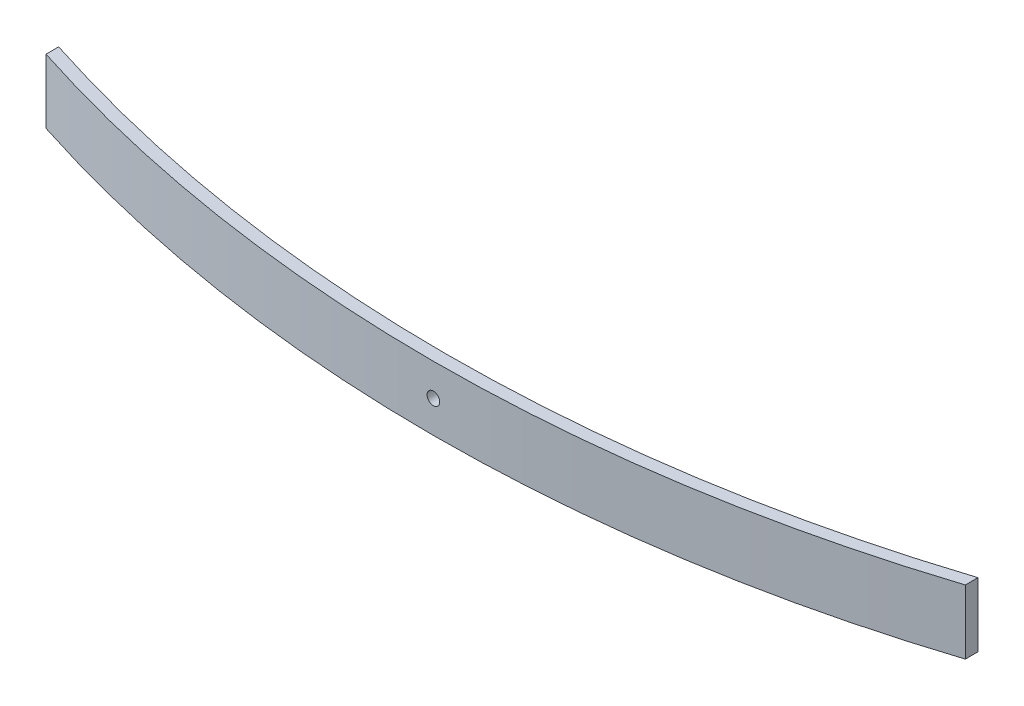
ISO-10303-21;
HEADER;
FILE_DESCRIPTION(('STEP AP214'),'2;1');
FILE_NAME('part.step','',(''),(''),'','','');
FILE_SCHEMA(('AUTOMOTIVE_DESIGN { 1 0 10303 214 1 1 1 1 }'));
ENDSEC;
DATA;
#1=APPLICATION_CONTEXT('core data for automotive mechanical design processes');
#2=APPLICATION_PROTOCOL_DEFINITION('international standard','automotive_design',2000,#1);
#3=PRODUCT_CONTEXT('',#1,'mechanical');
#4=PRODUCT('Part','Part','',(#3));
#5=PRODUCT_RELATED_PRODUCT_CATEGORY('part','',(#4));
#6=PRODUCT_DEFINITION_FORMATION('','',#4);
#7=PRODUCT_DEFINITION_CONTEXT('part definition',#1,'design');
#8=PRODUCT_DEFINITION('design','',#6,#7);
#9=PRODUCT_DEFINITION_SHAPE('','',#8);
#10=(LENGTH_UNIT() NAMED_UNIT(*) SI_UNIT(.MILLI.,.METRE.));
#11=(NAMED_UNIT(*) PLANE_ANGLE_UNIT() SI_UNIT($,.RADIAN.));
#12=(NAMED_UNIT(*) SI_UNIT($,.STERADIAN.) SOLID_ANGLE_UNIT());
#13=UNCERTAINTY_MEASURE_WITH_UNIT(LENGTH_MEASURE(1.E-05),#10,'distance_accuracy_value','');
#14=(GEOMETRIC_REPRESENTATION_CONTEXT(3) GLOBAL_UNCERTAINTY_ASSIGNED_CONTEXT((#13)) GLOBAL_UNIT_ASSIGNED_CONTEXT((#10,
#11,#12)) REPRESENTATION_CONTEXT('',''));
#15=CARTESIAN_POINT('',(0.,0.,0.));
#16=DIRECTION('',(0.,0.,1.));
#17=DIRECTION('',(1.,0.,0.));
#18=AXIS2_PLACEMENT_3D('',#15,#16,#17);
#19=CARTESIAN_POINT('',(6.91954253005793E-13,76.2,-1583.04997748713));
#20=DIRECTION('',(0.,-1.,0.));
#21=DIRECTION('',(0.,0.,-1.));
#22=AXIS2_PLACEMENT_3D('',#19,#20,#21);
#23=CYLINDRICAL_SURFACE('',#22,1776.04997748713);
#24=CARTESIAN_POINT('',(6.91954253005793E-13,0.,-1583.04997748713));
#25=DIRECTION('',(0.,1.,0.));
#26=DIRECTION('',(0.,0.,1.));
#27=AXIS2_PLACEMENT_3D('',#24,#25,#26);
#28=CIRCLE('',#27,1776.04997748713);
#29=CARTESIAN_POINT('',(545.021699517166,0.,107.306455217953));
#30=VERTEX_POINT('',#29);
#31=CARTESIAN_POINT('',(-545.021699517165,0.,107.306455217953));
#32=VERTEX_POINT('',#31);
#33=EDGE_CURVE('E121',#30,#32,#28,.F.);
#34=ORIENTED_EDGE('',*,*,#33,.F.);
#35=DIRECTION('',(0.,-1.,0.));
#36=VECTOR('',#35,1.);
#37=CARTESIAN_POINT('',(545.021699517166,76.2,107.306455217953));
#38=LINE('',#37,#36);
#39=CARTESIAN_POINT('',(545.021699517166,76.2,107.306455217953));
#40=VERTEX_POINT('',#39);
#41=EDGE_CURVE('E11',#40,#30,#38,.T.);
#42=ORIENTED_EDGE('',*,*,#41,.F.);
#43=CARTESIAN_POINT('',(6.91954253005793E-13,76.2,-1583.04997748713));
#44=DIRECTION('',(0.,1.,0.));
#45=DIRECTION('',(0.,0.,1.));
#46=AXIS2_PLACEMENT_3D('',#43,#44,#45);
#47=CIRCLE('',#46,1776.04997748713);
#48=CARTESIAN_POINT('',(-545.021699517165,76.2,107.306455217953));
#49=VERTEX_POINT('',#48);
#50=EDGE_CURVE('E113',#40,#49,#47,.F.);
#51=ORIENTED_EDGE('',*,*,#50,.T.);
#52=DIRECTION('',(0.,-1.,0.));
#53=VECTOR('',#52,1.);
#54=CARTESIAN_POINT('',(-545.021699517165,76.2,107.306455217953));
#55=LINE('',#54,#53);
#56=EDGE_CURVE('E94',#49,#32,#55,.T.);
#57=ORIENTED_EDGE('',*,*,#56,.T.);
#58=EDGE_LOOP('',(#34,#42,#51,#57));
#59=FACE_BOUND('',#58,.T.);
#60=CARTESIAN_POINT('',(6.91954253005793E-13,30.6,193.));
#61=CARTESIAN_POINT('',(-0.210713968094227,30.5999984867718,193.000000017793));
#62=CARTESIAN_POINT('',(-0.421403110930307,30.6088837241473,192.999962421728));
#63=CARTESIAN_POINT('',(-0.841354181845075,30.6443626478278,192.999813125687));
#64=CARTESIAN_POINT('',(-1.05061571988372,30.6709609920997,192.999701406219));
#65=CARTESIAN_POINT('',(-1.46633777348652,30.7417152082757,192.999406859924));
#66=CARTESIAN_POINT('',(-1.67279562512319,30.7858867143382,192.999223969782));
#67=CARTESIAN_POINT('',(-2.0813298290613,30.8914915499315,192.998792209094));
#68=CARTESIAN_POINT('',(-2.28340455125354,30.9529311869031,192.99854331444));
#69=CARTESIAN_POINT('',(-2.68152110119502,31.0925814227026,192.997986836868));
#70=CARTESIAN_POINT('',(-2.87756687230368,31.1707807807114,192.997679293301));
#71=CARTESIAN_POINT('',(-3.26237590887501,31.3434199132979,192.997014137911));
#72=CARTESIAN_POINT('',(-3.45113906456086,31.4378599325676,192.996656525334));
#73=CARTESIAN_POINT('',(-3.81998780495973,31.6422805388216,192.995901490769));
#74=CARTESIAN_POINT('',(-4.00007570143474,31.7522569546403,192.995504079474));
#75=CARTESIAN_POINT('',(-4.35035222525598,31.9869905222908,192.994680636077));
#76=CARTESIAN_POINT('',(-4.52054062300109,32.1117480167395,192.994254603313));
#77=CARTESIAN_POINT('',(-4.84979170206681,32.3751451316166,192.993386048449));
#78=CARTESIAN_POINT('',(-5.00885520931067,32.5137837196362,192.992943527578));
#79=CARTESIAN_POINT('',(-5.31479308067789,32.804015859957,192.992054369382));
#80=CARTESIAN_POINT('',(-5.46166320475902,32.9556138817967,192.991607730686));
#81=CARTESIAN_POINT('',(-5.74206362701607,33.2705952098563,192.990723311728));
#82=CARTESIAN_POINT('',(-5.87559815641338,33.4339747494297,192.990285528692));
#83=CARTESIAN_POINT('',(-6.12847828337017,33.7714630692385,192.989430939818));
#84=CARTESIAN_POINT('',(-6.24781862373892,33.9455757887628,192.989014141786));
#85=CARTESIAN_POINT('',(-6.47138111476824,34.3032005309569,192.988213616073));
#86=CARTESIAN_POINT('',(-6.57560639321524,34.4867105983514,192.987829881558));
#87=CARTESIAN_POINT('',(-6.76822875919948,34.8618615632203,192.98710627353));
#88=CARTESIAN_POINT('',(-6.85662560065925,35.0535025870455,192.986766400699));
#89=CARTESIAN_POINT('',(-7.01695887812265,35.4435460971775,192.986140178144));
#90=CARTESIAN_POINT('',(-7.08889566823617,35.6419484379205,192.98585382727));
#91=CARTESIAN_POINT('',(-7.21580133308599,36.0441127387914,192.985342762279));
#92=CARTESIAN_POINT('',(-7.27076981084048,36.2478748241922,192.985118049605));
#93=CARTESIAN_POINT('',(-7.36333699178468,36.6592665254965,192.984736685148));
#94=CARTESIAN_POINT('',(-7.40093897454976,36.8668954034648,192.984580020515));
#95=CARTESIAN_POINT('',(-7.45853120590766,37.2846549482939,192.984339094535));
#96=CARTESIAN_POINT('',(-7.47851535225067,37.4947864564638,192.984254858275));
#97=CARTESIAN_POINT('',(-7.50070359679289,37.9159102543566,192.984161289859));
#98=CARTESIAN_POINT('',(-7.50291408330494,38.1269022075299,192.98415193079));
#99=CARTESIAN_POINT('',(-7.48955360463759,38.5484004665777,192.984208322118));
#100=CARTESIAN_POINT('',(-7.47397607404448,38.7589065643839,192.984274100248));
#101=CARTESIAN_POINT('',(-7.42514452560697,39.1778160268159,192.984478922777));
#102=CARTESIAN_POINT('',(-7.39189401428347,39.3862198002114,192.984617952642));
#103=CARTESIAN_POINT('',(-7.30795445093899,39.7994886750939,192.984965325868));
#104=CARTESIAN_POINT('',(-7.25726512758641,40.0043537214695,192.985173670307));
#105=CARTESIAN_POINT('',(-7.13880941808669,40.4090816554468,192.985653753506));
#106=CARTESIAN_POINT('',(-7.07104334628342,40.6089446350507,192.985925491099));
#107=CARTESIAN_POINT('',(-6.91891409978115,41.0022558470397,192.986524655178));
#108=CARTESIAN_POINT('',(-6.8345505367465,41.1957039292102,192.986852082966));
#109=CARTESIAN_POINT('',(-6.64984230973413,41.5747716673117,192.987553267696));
#110=CARTESIAN_POINT('',(-6.54950055498283,41.7603927405773,192.9879270162));
#111=CARTESIAN_POINT('',(-6.33350673998462,42.1225834438655,192.988710406047));
#112=CARTESIAN_POINT('',(-6.2178493908568,42.2991499177421,192.989120059772));
#113=CARTESIAN_POINT('',(-5.97209494734002,42.6418601532703,192.98996341449));
#114=CARTESIAN_POINT('',(-5.84200303653242,42.808007623148,192.990397106822));
#115=CARTESIAN_POINT('',(-5.56830511634764,43.1287715124283,192.99127634415));
#116=CARTESIAN_POINT('',(-5.42469413510187,43.2833836517494,192.991721893463));
#117=CARTESIAN_POINT('',(-4.97502421482233,43.7281685004759,192.993057195178));
#118=CARTESIAN_POINT('',(-4.64986305950534,43.9996590137953,192.993946551662));
#119=CARTESIAN_POINT('',(-4.13197567971274,44.3627081259285,192.995201923407));
#120=CARTESIAN_POINT('',(-3.95423770702158,44.476400208607,192.99560743072));
#121=CARTESIAN_POINT('',(-3.58980904911005,44.6884506790729,192.996381434127));
#122=CARTESIAN_POINT('',(-3.40311815449559,44.7868087079931,192.996749929354));
#123=CARTESIAN_POINT('',(-2.8316530072115,45.0576661242202,192.99778332722));
#124=CARTESIAN_POINT('',(-2.43517114126789,45.2061693090255,192.998376934445));
#125=CARTESIAN_POINT('',(-1.62308827124615,45.4344169166339,192.999304792558));
#126=CARTESIAN_POINT('',(-1.20748726904315,45.5141613461805,192.999639043471));
#127=CARTESIAN_POINT('',(-0.368800144783835,45.6027859953173,193.000011208188));
#128=CARTESIAN_POINT('',(0.0542859194173199,45.6116667624026,193.000049124283));
#129=CARTESIAN_POINT('',(0.89613261813071,45.5581931101372,192.999823726225));
#130=CARTESIAN_POINT('',(1.31489325255112,45.4958386892742,192.999560412067));
#131=CARTESIAN_POINT('',(1.9303436787734,45.3504066256681,192.998962948761));
#132=CARTESIAN_POINT('',(2.1334669657173,45.2932419084604,192.998729895662));
#133=CARTESIAN_POINT('',(2.53416331768129,45.1620457959662,192.998203357605));
#134=CARTESIAN_POINT('',(2.73173651249174,45.0880147954716,192.997909874061));
#135=CARTESIAN_POINT('',(3.31406084676285,44.8412313409884,192.996950242197));
#136=CARTESIAN_POINT('',(3.68878109502303,44.643702073413,192.996204537467));
#137=CARTESIAN_POINT('',(4.22148178855349,44.3027303934533,192.994991984489));
#138=CARTESIAN_POINT('',(4.39423732139156,44.1815494254654,192.99457188216));
#139=CARTESIAN_POINT('',(4.72893486876222,43.9250760102941,192.993712173886));
#140=CARTESIAN_POINT('',(4.89088085068052,43.7897887877036,192.993272575197));
#141=CARTESIAN_POINT('',(5.2028389741045,43.5060131269228,192.992386135608));
#142=CARTESIAN_POINT('',(5.35284682055898,43.3575199778824,192.991939292171));
#143=CARTESIAN_POINT('',(5.6397731090037,43.0484737070598,192.99105133538));
#144=CARTESIAN_POINT('',(5.77669606336975,42.8879247771165,192.990610220097));
#145=CARTESIAN_POINT('',(6.03655633591654,42.5558335361285,192.989746002998));
#146=CARTESIAN_POINT('',(6.15949097179737,42.3842891264949,192.989322904647));
#147=CARTESIAN_POINT('',(6.39046942201517,42.0314575902563,192.98850682996));
#148=CARTESIAN_POINT('',(6.49851358458244,41.8501706916282,192.988113852918));
#149=CARTESIAN_POINT('',(6.69894774113189,41.4791360457973,192.987369158747));
#150=CARTESIAN_POINT('',(6.79133744698043,41.2893881429438,192.987017442377));
#151=CARTESIAN_POINT('',(6.95980221242439,40.9027865931229,192.986365267457));
#152=CARTESIAN_POINT('',(7.03587752593871,40.7059330568041,192.986064808109));
#153=CARTESIAN_POINT('',(7.17118720449908,40.306479201796,192.985523618733));
#154=CARTESIAN_POINT('',(7.23041839084969,40.1038778063374,192.985282899979));
#155=CARTESIAN_POINT('',(7.33158072491736,39.6944803968457,192.98486817799));
#156=CARTESIAN_POINT('',(7.37351824975515,39.4876859585839,192.984694150165));
#157=CARTESIAN_POINT('',(7.43983858987233,39.0712246263164,192.984417572838));
#158=CARTESIAN_POINT('',(7.46421508897779,38.8615567264146,192.984315049055));
#159=CARTESIAN_POINT('',(7.49521005598158,38.4409854893946,192.984184515178));
#160=CARTESIAN_POINT('',(7.50183466739308,38.2300826050059,192.984156479306));
#161=CARTESIAN_POINT('',(7.49729604901428,37.8084313167293,192.984175644233));
#162=CARTESIAN_POINT('',(7.48612970385177,37.5976829463639,192.984222858208));
#163=CARTESIAN_POINT('',(7.44608319144549,37.1778810074966,192.984391205324));
#164=CARTESIAN_POINT('',(7.41720343879293,36.9688273994439,192.984512336734));
#165=CARTESIAN_POINT('',(7.34193498439924,36.5538917028779,192.984825082016));
#166=CARTESIAN_POINT('',(7.29554590651526,36.3480096825968,192.985016697403));
#167=CARTESIAN_POINT('',(7.18558954382441,35.9408886735021,192.985464967259));
#168=CARTESIAN_POINT('',(7.12202252604807,35.7396496125666,192.985721620717));
#169=CARTESIAN_POINT('',(6.97814667319748,35.3431999543694,192.986292743016));
#170=CARTESIAN_POINT('',(6.89783430858562,35.1479906380158,192.986607224044));
#171=CARTESIAN_POINT('',(6.72107980430782,34.7651040508122,192.987284909401));
#172=CARTESIAN_POINT('',(6.6246436288667,34.5774240265772,192.987648095704));
#173=CARTESIAN_POINT('',(6.41627290528527,34.2107950839371,192.988413096412));
#174=CARTESIAN_POINT('',(6.30433343128913,34.0318489650879,192.988814923083));
#175=CARTESIAN_POINT('',(6.06581689289942,33.6840847361222,192.989645553125));
#176=CARTESIAN_POINT('',(5.93924490882296,33.515263141567,192.990074347111));
#177=CARTESIAN_POINT('',(5.67231991868936,33.1888660580897,192.990946907972));
#178=CARTESIAN_POINT('',(5.53196570521928,33.0312915565781,192.991390676157));
#179=CARTESIAN_POINT('',(5.23848659589243,32.7285285010311,192.992280544971));
#180=CARTESIAN_POINT('',(5.08536199605386,32.5833396600531,192.992726645546));
#181=CARTESIAN_POINT('',(4.76738488124515,32.3063385507572,192.993608647806));
#182=CARTESIAN_POINT('',(4.60252923302737,32.174529879134,192.994044546725));
#183=CARTESIAN_POINT('',(4.26230143452283,31.9252727160438,192.994893638276));
#184=CARTESIAN_POINT('',(4.08692944268945,31.8078240082912,192.995306831249));
#185=CARTESIAN_POINT('',(3.72679224644652,31.5880456665331,192.996099052417));
#186=CARTESIAN_POINT('',(3.54202080718477,31.4857262486002,192.996478057458));
#187=CARTESIAN_POINT('',(3.16457932589554,31.2970641063272,192.997190684133));
#188=CARTESIAN_POINT('',(2.97191219636486,31.2107155544448,192.997524322307));
#189=CARTESIAN_POINT('',(2.58015719959616,31.0546324777028,192.998136625653));
#190=CARTESIAN_POINT('',(2.38107520557399,30.9848832197952,192.998415339535));
#191=CARTESIAN_POINT('',(1.9778114443022,30.8624129523239,192.998910200255));
#192=CARTESIAN_POINT('',(1.77363103212966,30.8096874689386,192.999126363529));
#193=CARTESIAN_POINT('',(1.31020489979096,30.7106430274462,192.999535351372));
#194=CARTESIAN_POINT('',(1.04990557260826,30.6691871109608,192.99970896714));
#195=CARTESIAN_POINT('',(0.526391255001049,30.6138665423077,192.999941280342));
#196=CARTESIAN_POINT('',(0.263176264593172,30.6000018899827,192.999999977777));
#197=CARTESIAN_POINT('',(6.91954253005793E-13,30.6,193.));
#198=B_SPLINE_CURVE_WITH_KNOTS('',3,(#60,#61,#62,#63,#64,#65,#66,#67,#68,#69,#70,#71,#72,#73,
#74,#75,#76,#77,#78,#79,#80,#81,#82,#83,#84,#85,#86,#87,#88,#89,#90,#91,#92,#93,#94,#95,#96,#97,
#98,#99,#100,#101,#102,#103,#104,#105,#106,#107,#108,#109,#110,#111,#112,#113,#114,#115,#116,
#117,#118,#119,#120,#121,#122,#123,#124,#125,#126,#127,#128,#129,#130,#131,#132,#133,#134,#135,
#136,#137,#138,#139,#140,#141,#142,#143,#144,#145,#146,#147,#148,#149,#150,#151,#152,#153,#154,
#155,#156,#157,#158,#159,#160,#161,#162,#163,#164,#165,#166,#167,#168,#169,#170,#171,#172,#173,
#174,#175,#176,#177,#178,#179,#180,#181,#182,#183,#184,#185,#186,#187,#188,#189,#190,#191,#192,
#193,#194,#195,#196,#197),.UNSPECIFIED.,.T.,.F.,(4,2,2,2,2,2,2,2,2,2,2,2,2,2,2,2,2,2,2,2,2,2,2,
2,2,2,2,2,2,2,2,2,2,2,2,2,2,2,2,2,2,2,2,2,2,2,2,2,2,2,2,2,2,2,2,2,2,2,2,2,2,2,2,2,2,2,2,2,4),
(0.,0.631912024301777,1.2639902864152,1.89663214600144,2.52950538839113,3.16195548087539,
3.79441510307562,4.42670524595631,5.05901004782971,5.69126785680884,6.3237446098031,
6.95602004377837,7.58852893310258,8.2209067489129,8.85329439515875,9.48566843538515,
10.1180572691842,10.7503266306474,11.3828149038618,12.0150758342728,12.6475702025455,
13.2799391235442,13.9123178840565,14.5446850047721,15.177066922899,15.8093338315781,
16.4418196509556,17.0740790696136,17.7065719276866,18.9702098092056,19.602583667419,
20.2349723230349,21.4986105469059,22.7622486468442,24.0258769838608,25.2895053477042,
25.9218869189979,26.5542536895501,27.8178774792359,28.450372115571,29.0826333187677,
29.7151209754032,30.3473897231102,30.9797795065627,31.6121544983652,32.2445411283047,
32.8769179149983,33.509413959954,34.1416765599364,34.7741664524213,35.4064374266601,
36.0388191299599,36.6711860326123,37.3035665208155,37.9359371792494,38.5684412619989,
39.2007118959496,39.8331838838019,40.4654369370645,41.097745429307,41.7300392686788,
42.3625026260201,42.9949564562123,43.6278354202829,44.2604829982539,44.892566944869,
45.5244846453389,46.3137263294984,47.1029680091572),.UNSPECIFIED.);
#199=CARTESIAN_POINT('',(6.91954253005793E-13,30.6,193.));
#200=VERTEX_POINT('',#199);
#201=EDGE_CURVE('E124',#200,#200,#198,.T.);
#202=ORIENTED_EDGE('',*,*,#201,.T.);
#203=EDGE_LOOP('',(#202));
#204=FACE_BOUND('',#203,.T.);
#205=ADVANCED_FACE('F49',(#59,#204),#23,.T.);
#206=CARTESIAN_POINT('',(3.41240888505662E-13,76.2,-1598.04997748712));
#207=DIRECTION('',(0.,-1.,0.));
#208=DIRECTION('',(0.,0.,-1.));
#209=AXIS2_PLACEMENT_3D('',#206,#207,#208);
#210=CYLINDRICAL_SURFACE('',#209,1776.04997748712);
#211=CARTESIAN_POINT('',(3.41240888505662E-13,0.,-1598.04997748712));
#212=DIRECTION('',(0.,1.,0.));
#213=DIRECTION('',(0.,0.,1.));
#214=AXIS2_PLACEMENT_3D('',#211,#212,#213);
#215=CIRCLE('',#214,1776.04997748712);
#216=CARTESIAN_POINT('',(-545.021699517165,0.,92.3064552179532));
#217=VERTEX_POINT('',#216);
#218=CARTESIAN_POINT('',(545.021699517166,0.,92.3064552179535));
#219=VERTEX_POINT('',#218);
#220=EDGE_CURVE('E126',#217,#219,#215,.T.);
#221=ORIENTED_EDGE('',*,*,#220,.F.);
#222=DIRECTION('',(0.,-1.,0.));
#223=VECTOR('',#222,1.);
#224=CARTESIAN_POINT('',(-545.021699517165,76.2,92.3064552179532));
#225=LINE('',#224,#223);
#226=CARTESIAN_POINT('',(-545.021699517165,76.2,92.3064552179532));
#227=VERTEX_POINT('',#226);
#228=EDGE_CURVE('E87',#227,#217,#225,.T.);
#229=ORIENTED_EDGE('',*,*,#228,.F.);
#230=CARTESIAN_POINT('',(3.41240888505662E-13,76.2,-1598.04997748712));
#231=DIRECTION('',(0.,1.,0.));
#232=DIRECTION('',(0.,0.,1.));
#233=AXIS2_PLACEMENT_3D('',#230,#231,#232);
#234=CIRCLE('',#233,1776.04997748712);
#235=CARTESIAN_POINT('',(545.021699517166,76.2,92.3064552179535));
#236=VERTEX_POINT('',#235);
#237=EDGE_CURVE('E112',#227,#236,#234,.T.);
#238=ORIENTED_EDGE('',*,*,#237,.T.);
#239=DIRECTION('',(0.,-1.,0.));
#240=VECTOR('',#239,1.);
#241=CARTESIAN_POINT('',(545.021699517166,76.2,92.3064552179535));
#242=LINE('',#241,#240);
#243=EDGE_CURVE('E64',#236,#219,#242,.T.);
#244=ORIENTED_EDGE('',*,*,#243,.T.);
#245=EDGE_LOOP('',(#221,#229,#238,#244));
#246=FACE_BOUND('',#245,.T.);
#247=CARTESIAN_POINT('',(-7.5,38.1,177.984164226377));
#248=CARTESIAN_POINT('',(-7.50000151322819,37.8892860319145,177.984164208571));
#249=CARTESIAN_POINT('',(-7.49111627585349,37.6785968890879,177.984201804954));
#250=CARTESIAN_POINT('',(-7.45563735217615,37.2586458181922,177.984351102375));
#251=CARTESIAN_POINT('',(-7.42903900790671,37.0493842801633,177.984462822905));
#252=CARTESIAN_POINT('',(-7.35828479173724,36.63366222658,177.984757371678));
#253=CARTESIAN_POINT('',(-7.31411328567894,36.4272043749532,177.984940263235));
#254=CARTESIAN_POINT('',(-7.208508450096,36.018670171035,177.985372027225));
#255=CARTESIAN_POINT('',(-7.14706881313061,35.8165954488529,177.985620923766));
#256=CARTESIAN_POINT('',(-7.00741857734594,35.418478898933,177.98617740523));
#257=CARTESIAN_POINT('',(-6.92921921934607,35.2224331278356,177.986484950802));
#258=CARTESIAN_POINT('',(-6.75658008677935,34.837624091286,177.987150110131));
#259=CARTESIAN_POINT('',(-6.66214006752074,34.6488609356104,177.987507724643));
#260=CARTESIAN_POINT('',(-6.45771946129041,34.2800121952304,177.988262762777));
#261=CARTESIAN_POINT('',(-6.34774304548433,34.0999242987638,177.988660175705));
#262=CARTESIAN_POINT('',(-6.11300947786033,33.7496477749571,177.989483621892));
#263=CARTESIAN_POINT('',(-5.98825198342546,33.5794593772181,177.989909655814));
#264=CARTESIAN_POINT('',(-5.72485486856214,33.2502082981437,177.990778212374));
#265=CARTESIAN_POINT('',(-5.58621628054089,33.0911447908863,177.991220733785));
#266=CARTESIAN_POINT('',(-5.29598414021393,32.7852069194919,177.992109892413));
#267=CARTESIAN_POINT('',(-5.14438611836974,32.6383367953972,177.992556531002));
#268=CARTESIAN_POINT('',(-4.82940479029845,32.3579363731136,177.993440949047));
#269=CARTESIAN_POINT('',(-4.66602525071788,32.2244018437033,177.993878731278));
#270=CARTESIAN_POINT('',(-4.32853693089197,31.9715217167215,177.994733317997));
#271=CARTESIAN_POINT('',(-4.15442421135789,31.8521813763408,177.99515011468));
#272=CARTESIAN_POINT('',(-3.79679946915635,31.6286188852982,177.995950637268));
#273=CARTESIAN_POINT('',(-3.61328940176485,31.5243936068487,177.996334370008));
#274=CARTESIAN_POINT('',(-3.23813843690194,31.331771240859,177.997057974284));
#275=CARTESIAN_POINT('',(-3.04649741307953,31.2433743993964,177.997397845139));
#276=CARTESIAN_POINT('',(-2.65645390295346,31.083041121927,177.998024063725));
#277=CARTESIAN_POINT('',(-2.4580515622135,31.0111043318103,177.998310412606));
#278=CARTESIAN_POINT('',(-2.05588726134913,30.8841986669541,177.998821473858));
#279=CARTESIAN_POINT('',(-1.85212517595196,30.8292301891963,177.999046184785));
#280=CARTESIAN_POINT('',(-1.44073347465677,30.7366630082454,177.999427546169));
#281=CARTESIAN_POINT('',(-1.23310459669403,30.6990610254769,177.999584209475));
#282=CARTESIAN_POINT('',(-0.815345051876456,30.6414687941111,177.999825133398));
#283=CARTESIAN_POINT('',(-0.605213543712585,30.6214846477638,177.999909368927));
#284=CARTESIAN_POINT('',(-0.184089745831482,30.5992964032119,178.000002936514));
#285=CARTESIAN_POINT('',(0.0269022073360946,30.5970859166945,178.000012295484));
#286=CARTESIAN_POINT('',(0.44840046637314,30.6104463953503,177.999955904647));
#287=CARTESIAN_POINT('',(0.65890656417437,30.6260239259372,177.999890127108));
#288=CARTESIAN_POINT('',(1.07781602663256,30.6748554743656,177.999685306357));
#289=CARTESIAN_POINT('',(1.28621980005893,30.7081059856891,177.999546277678));
#290=CARTESIAN_POINT('',(1.69948867500321,30.792045549039,177.999198907314));
#291=CARTESIAN_POINT('',(1.90435372140975,30.842734872397,177.998990564549));
#292=CARTESIAN_POINT('',(2.30908165544806,30.9611905819128,177.998510484954));
#293=CARTESIAN_POINT('',(2.50894463508203,31.0289566537268,177.998238749291));
#294=CARTESIAN_POINT('',(2.90225584712975,31.1810859002556,177.997639589155));
#295=CARTESIAN_POINT('',(3.09570392932878,31.2654494633062,177.997312163378));
#296=CARTESIAN_POINT('',(3.474771667466,31.4501576903461,177.996610982501));
#297=CARTESIAN_POINT('',(3.6603927407395,31.5504994451075,177.996237235837));
#298=CARTESIAN_POINT('',(4.02258344404181,31.766493260127,177.99545384932));
#299=CARTESIAN_POINT('',(4.1991499179246,31.8821506092661,177.995044197084));
#300=CARTESIAN_POINT('',(4.54186015346291,32.1279050528061,177.994200844778));
#301=CARTESIAN_POINT('',(4.70800762334451,32.2579969636256,177.993767153369));
#302=CARTESIAN_POINT('',(5.02877151263007,32.5316948838342,177.992887917265));
#303=CARTESIAN_POINT('',(5.18338365195258,32.675305865092,177.992442368252));
#304=CARTESIAN_POINT('',(5.62816850065028,33.124975785377,177.991107066409));
#305=CARTESIAN_POINT('',(5.89965901394052,33.4501369406816,177.990217708469));
#306=CARTESIAN_POINT('',(6.26270812603403,33.968024320448,177.988962332907));
#307=CARTESIAN_POINT('',(6.37640020870004,34.1457622931292,177.988556824049));
#308=CARTESIAN_POINT('',(6.58845067914274,34.510190951019,177.987782817221));
#309=CARTESIAN_POINT('',(6.68680870805227,34.6968818456216,177.987414320118));
#310=CARTESIAN_POINT('',(6.95766612427186,35.2683469929126,177.986380916429));
#311=CARTESIAN_POINT('',(7.10616930907641,35.6648288588769,177.985787305057));
#312=CARTESIAN_POINT('',(7.33441691667697,36.4769117289435,177.98485943989));
#313=CARTESIAN_POINT('',(7.4141613462167,36.8925127311706,177.98452518607));
#314=CARTESIAN_POINT('',(7.50278599532745,37.7311998554401,177.98415301811));
#315=CARTESIAN_POINT('',(7.51166676240022,38.1542859196266,177.984115101681));
#316=CARTESIAN_POINT('',(7.45819311011506,38.9961326183076,177.984340501734));
#317=CARTESIAN_POINT('',(7.39583868924482,39.4148932527102,177.984603818221));
#318=CARTESIAN_POINT('',(7.25040662563846,40.0303436788814,177.985201286275));
#319=CARTESIAN_POINT('',(7.19324190843677,40.2334669657938,177.985434341165));
#320=CARTESIAN_POINT('',(7.06204579596008,40.6341633176956,177.98596088302));
#321=CARTESIAN_POINT('',(6.988014795477,40.8317365124754,177.986254368569));
#322=CARTESIAN_POINT('',(6.74123134103598,41.4140608466579,177.987214006388));
#323=CARTESIAN_POINT('',(6.54370207349932,41.7887810948626,177.987959715012));
#324=CARTESIAN_POINT('',(6.2027303935909,42.3214817883514,177.98917227251));
#325=CARTESIAN_POINT('',(6.08154942560718,42.4942373211955,177.989592376125));
#326=CARTESIAN_POINT('',(5.82507601044285,42.8289348685792,177.990452086404));
#327=CARTESIAN_POINT('',(5.68978878785504,42.9908808505045,177.990891685812));
#328=CARTESIAN_POINT('',(5.40601312707813,43.3028389739433,177.991778126147));
#329=CARTESIAN_POINT('',(5.25751997803879,43.4528468204056,177.992224969611));
#330=CARTESIAN_POINT('',(4.9484737072162,43.7397731088667,177.993112925805));
#331=CARTESIAN_POINT('',(4.78792477727201,43.8766960632411,177.993554040465));
#332=CARTESIAN_POINT('',(4.45583353628019,44.1365563358048,177.994418255711));
#333=CARTESIAN_POINT('',(4.28428912664369,44.2594909716942,177.994841352832));
#334=CARTESIAN_POINT('',(3.93145759039771,44.4904694219284,177.995657424618));
#335=CARTESIAN_POINT('',(3.75017069176506,44.5985135845037,177.996050399988));
#336=CARTESIAN_POINT('',(3.37913604592412,44.7989477410682,177.99679509052));
#337=CARTESIAN_POINT('',(3.18938814306503,44.8913374469237,177.997146804922));
#338=CARTESIAN_POINT('',(2.80278659323259,45.0598022123805,177.997798975874));
#339=CARTESIAN_POINT('',(2.60593305690778,45.1358775259005,177.998099433222));
#340=CARTESIAN_POINT('',(2.20647920190445,45.2711872044654,177.998640618766));
#341=CARTESIAN_POINT('',(2.00387780645707,45.3304183908162,177.998881335688));
#342=CARTESIAN_POINT('',(1.59448039698904,45.4315807248859,177.999296054415));
#343=CARTESIAN_POINT('',(1.38768595873947,45.4735182497255,177.99947008081));
#344=CARTESIAN_POINT('',(0.971224626496974,45.5398385898484,177.999746655793));
#345=CARTESIAN_POINT('',(0.761556726607794,45.5642150889577,177.999849178662));
#346=CARTESIAN_POINT('',(0.340985489613201,45.5952100559713,177.999979711378));
#347=CARTESIAN_POINT('',(0.130082605237177,45.6018346673887,178.000007747002));
#348=CARTESIAN_POINT('',(-0.291568683048706,45.5972960490235,177.999988582247));
#349=CARTESIAN_POINT('',(-0.502317053436063,45.5861297038658,177.99994136869));
#350=CARTESIAN_POINT('',(-0.922118992347886,45.5460831914654,177.999773023057));
#351=CARTESIAN_POINT('',(-1.13117260042309,45.5172034388139,177.99965189271));
#352=CARTESIAN_POINT('',(-1.54610829703443,45.4419349844183,177.999339150039));
#353=CARTESIAN_POINT('',(-1.75199031733827,45.3955459065315,177.9991475362));
#354=CARTESIAN_POINT('',(-2.15911132647842,45.2855895438309,177.998699269789));
#355=CARTESIAN_POINT('',(-2.36035038743662,45.2220225260477,177.998442618228));
#356=CARTESIAN_POINT('',(-2.75680004567823,45.0781466731794,177.997871499834));
#357=CARTESIAN_POINT('',(-2.95200936205342,44.9978343085567,177.997557020813));
#358=CARTESIAN_POINT('',(-3.33489594929877,44.8210798042535,177.99687933939));
#359=CARTESIAN_POINT('',(-3.52257597355381,44.7246436287978,177.996516155014));
#360=CARTESIAN_POINT('',(-3.88920491623114,44.5162729051841,177.995751157795));
#361=CARTESIAN_POINT('',(-4.06815103509762,44.4043334311702,177.995349332689));
#362=CARTESIAN_POINT('',(-4.41591526409443,44.1658168927426,177.994518705298));
#363=CARTESIAN_POINT('',(-4.58473685866347,44.0392449086459,177.994089912401));
#364=CARTESIAN_POINT('',(-4.9111339421384,43.7723199184915,177.993217353088));
#365=CARTESIAN_POINT('',(-5.0687084436356,43.631965705023,177.992773585362));
#366=CARTESIAN_POINT('',(-5.37147149915389,43.3384865957023,177.991883716795));
#367=CARTESIAN_POINT('',(-5.51666034011747,43.1853619958683,177.991437616009));
#368=CARTESIAN_POINT('',(-5.79366144938522,42.8673848810716,177.99055561267));
#369=CARTESIAN_POINT('',(-5.9254701209946,42.7025292328611,177.990119712884));
#370=CARTESIAN_POINT('',(-6.17472728405848,42.3623014343739,177.989270619054));
#371=CARTESIAN_POINT('',(-6.29217599179849,42.1869294425506,177.988857424669));
#372=CARTESIAN_POINT('',(-6.51195433354262,41.8267922463143,177.988065200254));
#373=CARTESIAN_POINT('',(-6.61427375147285,41.6420208070485,177.987686193377));
#374=CARTESIAN_POINT('',(-6.80293589374009,41.264579325751,177.986973562955));
#375=CARTESIAN_POINT('',(-6.88928444561939,41.0719121962162,177.986639922868));
#376=CARTESIAN_POINT('',(-7.04536752235469,40.6801571994393,177.98602761556));
#377=CARTESIAN_POINT('',(-7.11511678025875,40.4810752054131,177.985748899626));
#378=CARTESIAN_POINT('',(-7.23758704772251,40.0778114441325,177.985254035172));
#379=CARTESIAN_POINT('',(-7.29031253110392,39.8736310319553,177.985037870214));
#380=CARTESIAN_POINT('',(-7.38935697257925,39.410204899641,177.984628879072));
#381=CARTESIAN_POINT('',(-7.43081288905515,39.1499055724881,177.984455261811));
#382=CARTESIAN_POINT('',(-7.48613345769553,38.6263912549405,177.984222946583));
#383=CARTESIAN_POINT('',(-7.49999811001735,38.3631762645626,177.984164248616));
#384=CARTESIAN_POINT('',(-7.5,38.1,177.984164226377));
#385=B_SPLINE_CURVE_WITH_KNOTS('',3,(#247,#248,#249,#250,#251,#252,#253,#254,#255,#256,#257,
#258,#259,#260,#261,#262,#263,#264,#265,#266,#267,#268,#269,#270,#271,#272,#273,#274,#275,#276,
#277,#278,#279,#280,#281,#282,#283,#284,#285,#286,#287,#288,#289,#290,#291,#292,#293,#294,#295,
#296,#297,#298,#299,#300,#301,#302,#303,#304,#305,#306,#307,#308,#309,#310,#311,#312,#313,#314,
#315,#316,#317,#318,#319,#320,#321,#322,#323,#324,#325,#326,#327,#328,#329,#330,#331,#332,#333,
#334,#335,#336,#337,#338,#339,#340,#341,#342,#343,#344,#345,#346,#347,#348,#349,#350,#351,#352,
#353,#354,#355,#356,#357,#358,#359,#360,#361,#362,#363,#364,#365,#366,#367,#368,#369,#370,#371,
#372,#373,#374,#375,#376,#377,#378,#379,#380,#381,#382,#383,#384),.UNSPECIFIED.,.T.,.F.,(4,2,2,
2,2,2,2,2,2,2,2,2,2,2,2,2,2,2,2,2,2,2,2,2,2,2,2,2,2,2,2,2,2,2,2,2,2,2,2,2,2,2,2,2,2,2,2,2,2,2,2,
2,2,2,2,2,2,2,2,2,2,2,2,2,2,2,2,2,4),(0.,0.631912024273445,1.26399028635864,1.89663214591711,
2.52950538827904,3.16195548073079,3.79441510289857,4.42670524574721,5.05901004758862,
5.69126785660492,6.32374460963637,6.95602004364789,7.58852893300835,8.22090674880479,
8.85329439503678,9.48566843524988,10.1180572690357,10.7503266304816,11.3828149036786,
12.015075834073,12.6475702023291,13.2799391234167,13.9123178840178,14.5446850048214,
15.1770669230362,15.8093338317406,16.4418196511433,17.0740790698267,17.7065719279251,
18.9702098093707,19.6025836675478,20.2349723231275,21.4986105470723,22.7622486470823,
24.0258769840529,25.2895053478503,25.9218869190543,26.554253689517,27.8178774790259,
28.4503721153762,29.0826333185882,29.7151209752384,30.3473897229599,30.9797795064268,
31.6121544982437,32.2445411281974,32.8769179149055,33.5094139598227,34.1416765597669,
34.7741664522143,35.4064374264159,36.0388191297804,36.6711860324976,37.3035665207648,
37.9359371792628,38.5684412620756,39.2007118960894,39.8331838840045,40.4654369373298,
41.0977454295341,41.7300392688676,42.3625026261715,42.9949564563263,43.6278354204137,
44.2604829984014,44.8925669450324,45.5244846455181,46.313726329588,47.1029680091571),.UNSPECIFIED.);
#386=CARTESIAN_POINT('',(-7.5,38.1,177.984164226377));
#387=VERTEX_POINT('',#386);
#388=EDGE_CURVE('E53',#387,#387,#385,.T.);
#389=ORIENTED_EDGE('',*,*,#388,.T.);
#390=EDGE_LOOP('',(#389));
#391=FACE_BOUND('',#390,.T.);
#392=ADVANCED_FACE('F115',(#246,#391),#210,.F.);
#393=CARTESIAN_POINT('',(545.021699517166,76.2,0.));
#394=DIRECTION('',(1.,0.,0.));
#395=DIRECTION('',(0.,0.,-1.));
#396=AXIS2_PLACEMENT_3D('',#393,#394,#395);
#397=PLANE('',#396);
#398=DIRECTION('',(0.,0.,1.));
#399=VECTOR('',#398,1.);
#400=CARTESIAN_POINT('',(545.021699517166,0.,0.));
#401=LINE('',#400,#399);
#402=EDGE_CURVE('E105',#219,#30,#401,.T.);
#403=ORIENTED_EDGE('',*,*,#402,.F.);
#404=ORIENTED_EDGE('',*,*,#243,.F.);
#405=DIRECTION('',(0.,0.,1.));
#406=VECTOR('',#405,1.);
#407=CARTESIAN_POINT('',(545.021699517166,76.2,0.));
#408=LINE('',#407,#406);
#409=EDGE_CURVE('E103',#236,#40,#408,.T.);
#410=ORIENTED_EDGE('',*,*,#409,.T.);
#411=ORIENTED_EDGE('',*,*,#41,.T.);
#412=EDGE_LOOP('',(#403,#404,#410,#411));
#413=FACE_BOUND('',#412,.T.);
#414=ADVANCED_FACE('F102',(#413),#397,.T.);
#415=CARTESIAN_POINT('',(-545.021699517165,76.2,0.));
#416=DIRECTION('',(1.,0.,0.));
#417=DIRECTION('',(0.,0.,-1.));
#418=AXIS2_PLACEMENT_3D('',#415,#416,#417);
#419=PLANE('',#418);
#420=DIRECTION('',(0.,0.,1.));
#421=VECTOR('',#420,1.);
#422=CARTESIAN_POINT('',(-545.021699517165,0.,0.));
#423=LINE('',#422,#421);
#424=EDGE_CURVE('E128',#217,#32,#423,.T.);
#425=ORIENTED_EDGE('',*,*,#424,.T.);
#426=ORIENTED_EDGE('',*,*,#56,.F.);
#427=DIRECTION('',(0.,0.,1.));
#428=VECTOR('',#427,1.);
#429=CARTESIAN_POINT('',(-545.021699517165,76.2,0.));
#430=LINE('',#429,#428);
#431=EDGE_CURVE('E72',#227,#49,#430,.T.);
#432=ORIENTED_EDGE('',*,*,#431,.F.);
#433=ORIENTED_EDGE('',*,*,#228,.T.);
#434=EDGE_LOOP('',(#425,#426,#432,#433));
#435=FACE_BOUND('',#434,.T.);
#436=ADVANCED_FACE('F145',(#435),#419,.F.);
#437=CARTESIAN_POINT('',(0.,76.2,0.));
#438=DIRECTION('',(0.,1.,0.));
#439=DIRECTION('',(0.,0.,1.));
#440=AXIS2_PLACEMENT_3D('',#437,#438,#439);
#441=PLANE('',#440);
#442=ORIENTED_EDGE('',*,*,#50,.F.);
#443=ORIENTED_EDGE('',*,*,#409,.F.);
#444=ORIENTED_EDGE('',*,*,#237,.F.);
#445=ORIENTED_EDGE('',*,*,#431,.T.);
#446=EDGE_LOOP('',(#442,#443,#444,#445));
#447=FACE_BOUND('',#446,.T.);
#448=ADVANCED_FACE('F111',(#447),#441,.T.);
#449=CARTESIAN_POINT('',(0.,0.,0.));
#450=DIRECTION('',(0.,1.,0.));
#451=DIRECTION('',(0.,0.,1.));
#452=AXIS2_PLACEMENT_3D('',#449,#450,#451);
#453=PLANE('',#452);
#454=ORIENTED_EDGE('',*,*,#33,.T.);
#455=ORIENTED_EDGE('',*,*,#424,.F.);
#456=ORIENTED_EDGE('',*,*,#220,.T.);
#457=ORIENTED_EDGE('',*,*,#402,.T.);
#458=EDGE_LOOP('',(#454,#455,#456,#457));
#459=FACE_BOUND('',#458,.T.);
#460=ADVANCED_FACE('F140',(#459),#453,.F.);
#461=CARTESIAN_POINT('',(0.,38.1,193.));
#462=DIRECTION('',(0.,0.,-1.));
#463=DIRECTION('',(-1.,0.,0.));
#464=AXIS2_PLACEMENT_3D('',#461,#462,#463);
#465=CYLINDRICAL_SURFACE('',#464,7.5);
#466=ORIENTED_EDGE('',*,*,#388,.F.);
#467=EDGE_LOOP('',(#466));
#468=FACE_BOUND('',#467,.T.);
#469=ORIENTED_EDGE('',*,*,#201,.F.);
#470=EDGE_LOOP('',(#469));
#471=FACE_BOUND('',#470,.T.);
#472=ADVANCED_FACE('F136',(#468,#471),#465,.F.);
#473=CLOSED_SHELL('',(#205,#392,#414,#436,#448,#460,#472));
#474=MANIFOLD_SOLID_BREP('B2',#473);
#475=ADVANCED_BREP_SHAPE_REPRESENTATION('',(#18,#474),#14);
#476=SHAPE_DEFINITION_REPRESENTATION(#9,#475);
ENDSEC;
END-ISO-10303-21;
